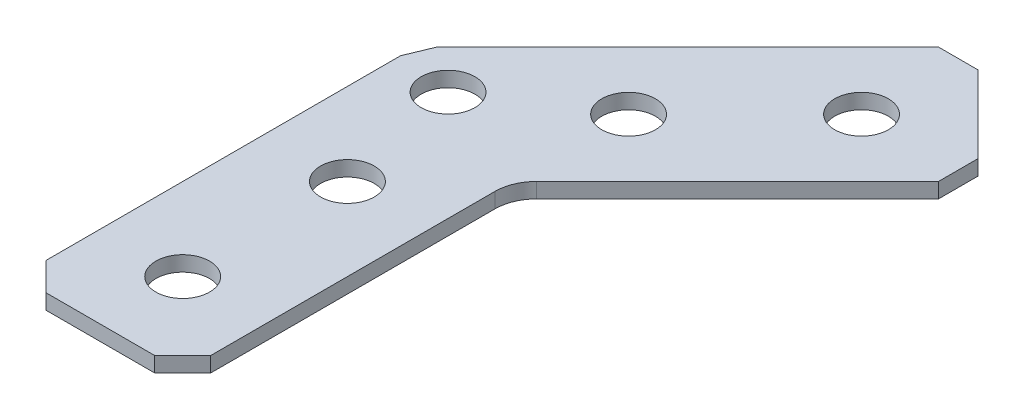
ISO-10303-21;
HEADER;
FILE_DESCRIPTION(('STEP AP214'),'2;1');
FILE_NAME('part.step','',(''),(''),'','','');
FILE_SCHEMA(('AUTOMOTIVE_DESIGN { 1 0 10303 214 1 1 1 1 }'));
ENDSEC;
DATA;
#1=APPLICATION_CONTEXT('core data for automotive mechanical design processes');
#2=APPLICATION_PROTOCOL_DEFINITION('international standard','automotive_design',2000,#1);
#3=PRODUCT_CONTEXT('',#1,'mechanical');
#4=PRODUCT('Part','Part','',(#3));
#5=PRODUCT_RELATED_PRODUCT_CATEGORY('part','',(#4));
#6=PRODUCT_DEFINITION_FORMATION('','',#4);
#7=PRODUCT_DEFINITION_CONTEXT('part definition',#1,'design');
#8=PRODUCT_DEFINITION('design','',#6,#7);
#9=PRODUCT_DEFINITION_SHAPE('','',#8);
#10=(LENGTH_UNIT() NAMED_UNIT(*) SI_UNIT(.MILLI.,.METRE.));
#11=(NAMED_UNIT(*) PLANE_ANGLE_UNIT() SI_UNIT($,.RADIAN.));
#12=(NAMED_UNIT(*) SI_UNIT($,.STERADIAN.) SOLID_ANGLE_UNIT());
#13=UNCERTAINTY_MEASURE_WITH_UNIT(LENGTH_MEASURE(1.E-05),#10,'distance_accuracy_value','');
#14=(GEOMETRIC_REPRESENTATION_CONTEXT(3) GLOBAL_UNCERTAINTY_ASSIGNED_CONTEXT((#13)) GLOBAL_UNIT_ASSIGNED_CONTEXT((#10,
#11,#12)) REPRESENTATION_CONTEXT('',''));
#15=CARTESIAN_POINT('',(0.,0.,0.));
#16=DIRECTION('',(0.,0.,1.));
#17=DIRECTION('',(1.,0.,0.));
#18=AXIS2_PLACEMENT_3D('',#15,#16,#17);
#19=CARTESIAN_POINT('',(22.7838687015566,0.,-32.18715578272));
#20=DIRECTION('',(0.70710678118655,0.,-0.707106781186545));
#21=DIRECTION('',(-0.707106781186545,0.,-0.70710678118655));
#22=AXIS2_PLACEMENT_3D('',#19,#20,#21);
#23=PLANE('',#22);
#24=DIRECTION('',(-0.707106781186545,0.,-0.70710678118655));
#25=VECTOR('',#24,1.);
#26=CARTESIAN_POINT('',(22.7838687015566,1.1684,-32.18715578272));
#27=LINE('',#26,#25);
#28=CARTESIAN_POINT('',(22.7838687015566,1.1684,-32.18715578272));
#29=VERTEX_POINT('',#28);
#30=CARTESIAN_POINT('',(16.856899661651,1.1684,-38.1141248226257));
#31=VERTEX_POINT('',#30);
#32=EDGE_CURVE('E153',#29,#31,#27,.T.);
#33=ORIENTED_EDGE('',*,*,#32,.F.);
#34=DIRECTION('',(0.,1.,0.));
#35=VECTOR('',#34,1.);
#36=CARTESIAN_POINT('',(22.7838687015566,0.,-32.18715578272));
#37=LINE('',#36,#35);
#38=CARTESIAN_POINT('',(22.7838687015566,0.,-32.18715578272));
#39=VERTEX_POINT('',#38);
#40=EDGE_CURVE('E11',#39,#29,#37,.T.);
#41=ORIENTED_EDGE('',*,*,#40,.F.);
#42=DIRECTION('',(-0.707106781186545,0.,-0.70710678118655));
#43=VECTOR('',#42,1.);
#44=CARTESIAN_POINT('',(22.7838687015566,0.,-32.18715578272));
#45=LINE('',#44,#43);
#46=CARTESIAN_POINT('',(16.856899661651,0.,-38.1141248226257));
#47=VERTEX_POINT('',#46);
#48=EDGE_CURVE('E186',#39,#47,#45,.T.);
#49=ORIENTED_EDGE('',*,*,#48,.T.);
#50=DIRECTION('',(0.,1.,0.));
#51=VECTOR('',#50,1.);
#52=CARTESIAN_POINT('',(16.856899661651,0.,-38.1141248226257));
#53=LINE('',#52,#51);
#54=EDGE_CURVE('E35',#47,#31,#53,.T.);
#55=ORIENTED_EDGE('',*,*,#54,.T.);
#56=EDGE_LOOP('',(#33,#41,#49,#55));
#57=FACE_BOUND('',#56,.T.);
#58=ADVANCED_FACE('F32',(#57),#23,.T.);
#59=CARTESIAN_POINT('',(22.7838687015566,0.,-29.1338687015565));
#60=DIRECTION('',(1.,0.,0.));
#61=DIRECTION('',(0.,0.,-1.));
#62=AXIS2_PLACEMENT_3D('',#59,#60,#61);
#63=PLANE('',#62);
#64=DIRECTION('',(0.,0.,-1.));
#65=VECTOR('',#64,1.);
#66=CARTESIAN_POINT('',(22.7838687015566,1.1684,-29.1338687015565));
#67=LINE('',#66,#65);
#68=CARTESIAN_POINT('',(22.7838687015566,1.1684,-29.1338687015565));
#69=VERTEX_POINT('',#68);
#70=EDGE_CURVE('E184',#69,#29,#67,.T.);
#71=ORIENTED_EDGE('',*,*,#70,.F.);
#72=DIRECTION('',(0.,1.,0.));
#73=VECTOR('',#72,1.);
#74=CARTESIAN_POINT('',(22.7838687015566,0.,-29.1338687015565));
#75=LINE('',#74,#73);
#76=CARTESIAN_POINT('',(22.7838687015566,0.,-29.1338687015565));
#77=VERTEX_POINT('',#76);
#78=EDGE_CURVE('E41',#77,#69,#75,.T.);
#79=ORIENTED_EDGE('',*,*,#78,.F.);
#80=DIRECTION('',(0.,0.,-1.));
#81=VECTOR('',#80,1.);
#82=CARTESIAN_POINT('',(22.7838687015566,0.,-29.1338687015565));
#83=LINE('',#82,#81);
#84=EDGE_CURVE('E143',#77,#39,#83,.T.);
#85=ORIENTED_EDGE('',*,*,#84,.T.);
#86=ORIENTED_EDGE('',*,*,#40,.T.);
#87=EDGE_LOOP('',(#71,#79,#85,#86));
#88=FACE_BOUND('',#87,.T.);
#89=ADVANCED_FACE('F206',(#88),#63,.T.);
#90=CARTESIAN_POINT('',(7.27993596973271,0.,-13.6299359697327));
#91=DIRECTION('',(0.707106781186546,0.,0.707106781186549));
#92=DIRECTION('',(0.707106781186549,0.,-0.707106781186546));
#93=AXIS2_PLACEMENT_3D('',#90,#91,#92);
#94=PLANE('',#93);
#95=DIRECTION('',(0.707106781186549,0.,-0.707106781186546));
#96=VECTOR('',#95,1.);
#97=CARTESIAN_POINT('',(7.27993596973271,1.1684,-13.6299359697327));
#98=LINE('',#97,#96);
#99=CARTESIAN_POINT('',(7.27993596973271,1.1684,-13.6299359697327));
#100=VERTEX_POINT('',#99);
#101=EDGE_CURVE('E130',#100,#69,#98,.T.);
#102=ORIENTED_EDGE('',*,*,#101,.F.);
#103=DIRECTION('',(0.,1.,0.));
#104=VECTOR('',#103,1.);
#105=CARTESIAN_POINT('',(7.27993596973271,0.,-13.6299359697327));
#106=LINE('',#105,#104);
#107=CARTESIAN_POINT('',(7.27993596973271,0.,-13.6299359697327));
#108=VERTEX_POINT('',#107);
#109=EDGE_CURVE('E125',#108,#100,#106,.T.);
#110=ORIENTED_EDGE('',*,*,#109,.F.);
#111=DIRECTION('',(0.707106781186549,0.,-0.707106781186546));
#112=VECTOR('',#111,1.);
#113=CARTESIAN_POINT('',(7.27993596973271,0.,-13.6299359697327));
#114=LINE('',#113,#112);
#115=EDGE_CURVE('E128',#108,#77,#114,.T.);
#116=ORIENTED_EDGE('',*,*,#115,.T.);
#117=ORIENTED_EDGE('',*,*,#78,.T.);
#118=EDGE_LOOP('',(#102,#110,#116,#117));
#119=FACE_BOUND('',#118,.T.);
#120=ADVANCED_FACE('F127',(#119),#94,.T.);
#121=CARTESIAN_POINT('',(9.525,0.,-11.3848719394654));
#122=DIRECTION('',(0.,1.,0.));
#123=DIRECTION('',(0.,0.,1.));
#124=AXIS2_PLACEMENT_3D('',#121,#122,#123);
#125=CYLINDRICAL_SURFACE('',#124,3.175);
#126=CARTESIAN_POINT('',(9.525,1.1684,-11.3848719394654));
#127=DIRECTION('',(0.,-1.,0.));
#128=DIRECTION('',(0.,0.,-1.));
#129=AXIS2_PLACEMENT_3D('',#126,#127,#128);
#130=CIRCLE('',#129,3.175);
#131=CARTESIAN_POINT('',(6.35,1.1684,-11.3848719394654));
#132=VERTEX_POINT('',#131);
#133=EDGE_CURVE('E181',#132,#100,#130,.T.);
#134=ORIENTED_EDGE('',*,*,#133,.F.);
#135=DIRECTION('',(0.,1.,0.));
#136=VECTOR('',#135,1.);
#137=CARTESIAN_POINT('',(6.35,0.,-11.3848719394654));
#138=LINE('',#137,#136);
#139=CARTESIAN_POINT('',(6.35,0.,-11.3848719394654));
#140=VERTEX_POINT('',#139);
#141=EDGE_CURVE('E135',#140,#132,#138,.T.);
#142=ORIENTED_EDGE('',*,*,#141,.F.);
#143=CARTESIAN_POINT('',(9.525,0.,-11.3848719394654));
#144=DIRECTION('',(0.,-1.,0.));
#145=DIRECTION('',(0.,0.,-1.));
#146=AXIS2_PLACEMENT_3D('',#143,#144,#145);
#147=CIRCLE('',#146,3.175);
#148=EDGE_CURVE('E141',#140,#108,#147,.T.);
#149=ORIENTED_EDGE('',*,*,#148,.T.);
#150=ORIENTED_EDGE('',*,*,#109,.T.);
#151=EDGE_LOOP('',(#134,#142,#149,#150));
#152=FACE_BOUND('',#151,.T.);
#153=ADVANCED_FACE('F145',(#152),#125,.F.);
#154=CARTESIAN_POINT('',(6.35,0.,10.541));
#155=DIRECTION('',(1.,0.,0.));
#156=DIRECTION('',(0.,0.,-1.));
#157=AXIS2_PLACEMENT_3D('',#154,#155,#156);
#158=PLANE('',#157);
#159=DIRECTION('',(0.,0.,-1.));
#160=VECTOR('',#159,1.);
#161=CARTESIAN_POINT('',(6.35,1.1684,10.541));
#162=LINE('',#161,#160);
#163=CARTESIAN_POINT('',(6.35,1.1684,10.541));
#164=VERTEX_POINT('',#163);
#165=EDGE_CURVE('E178',#164,#132,#162,.T.);
#166=ORIENTED_EDGE('',*,*,#165,.F.);
#167=DIRECTION('',(0.,1.,0.));
#168=VECTOR('',#167,1.);
#169=CARTESIAN_POINT('',(6.35,0.,10.541));
#170=LINE('',#169,#168);
#171=CARTESIAN_POINT('',(6.35,0.,10.541));
#172=VERTEX_POINT('',#171);
#173=EDGE_CURVE('E190',#172,#164,#170,.T.);
#174=ORIENTED_EDGE('',*,*,#173,.F.);
#175=DIRECTION('',(0.,0.,-1.));
#176=VECTOR('',#175,1.);
#177=CARTESIAN_POINT('',(6.35,0.,10.541));
#178=LINE('',#177,#176);
#179=EDGE_CURVE('E146',#172,#140,#178,.T.);
#180=ORIENTED_EDGE('',*,*,#179,.T.);
#181=ORIENTED_EDGE('',*,*,#141,.T.);
#182=EDGE_LOOP('',(#166,#174,#180,#181));
#183=FACE_BOUND('',#182,.T.);
#184=ADVANCED_FACE('F219',(#183),#158,.T.);
#185=CARTESIAN_POINT('',(4.19099999999999,0.,12.7));
#186=DIRECTION('',(0.707106781186546,0.,0.707106781186549));
#187=DIRECTION('',(0.707106781186549,0.,-0.707106781186546));
#188=AXIS2_PLACEMENT_3D('',#185,#186,#187);
#189=PLANE('',#188);
#190=DIRECTION('',(0.707106781186549,0.,-0.707106781186546));
#191=VECTOR('',#190,1.);
#192=CARTESIAN_POINT('',(4.19099999999999,1.1684,12.7));
#193=LINE('',#192,#191);
#194=CARTESIAN_POINT('',(4.19099999999999,1.1684,12.7));
#195=VERTEX_POINT('',#194);
#196=EDGE_CURVE('E175',#195,#164,#193,.T.);
#197=ORIENTED_EDGE('',*,*,#196,.F.);
#198=DIRECTION('',(0.,1.,0.));
#199=VECTOR('',#198,1.);
#200=CARTESIAN_POINT('',(4.19099999999999,0.,12.7));
#201=LINE('',#200,#199);
#202=CARTESIAN_POINT('',(4.19099999999999,0.,12.7));
#203=VERTEX_POINT('',#202);
#204=EDGE_CURVE('E192',#203,#195,#201,.T.);
#205=ORIENTED_EDGE('',*,*,#204,.F.);
#206=DIRECTION('',(0.707106781186549,0.,-0.707106781186546));
#207=VECTOR('',#206,1.);
#208=CARTESIAN_POINT('',(4.19099999999999,0.,12.7));
#209=LINE('',#208,#207);
#210=EDGE_CURVE('E148',#203,#172,#209,.T.);
#211=ORIENTED_EDGE('',*,*,#210,.T.);
#212=ORIENTED_EDGE('',*,*,#173,.T.);
#213=EDGE_LOOP('',(#197,#205,#211,#212));
#214=FACE_BOUND('',#213,.T.);
#215=ADVANCED_FACE('F222',(#214),#189,.T.);
#216=CARTESIAN_POINT('',(-4.191,0.,12.7));
#217=DIRECTION('',(0.,0.,1.));
#218=DIRECTION('',(1.,0.,0.));
#219=AXIS2_PLACEMENT_3D('',#216,#217,#218);
#220=PLANE('',#219);
#221=DIRECTION('',(1.,0.,0.));
#222=VECTOR('',#221,1.);
#223=CARTESIAN_POINT('',(-4.191,1.1684,12.7));
#224=LINE('',#223,#222);
#225=CARTESIAN_POINT('',(-4.191,1.1684,12.7));
#226=VERTEX_POINT('',#225);
#227=EDGE_CURVE('E172',#226,#195,#224,.T.);
#228=ORIENTED_EDGE('',*,*,#227,.F.);
#229=DIRECTION('',(0.,1.,0.));
#230=VECTOR('',#229,1.);
#231=CARTESIAN_POINT('',(-4.191,0.,12.7));
#232=LINE('',#231,#230);
#233=CARTESIAN_POINT('',(-4.191,0.,12.7));
#234=VERTEX_POINT('',#233);
#235=EDGE_CURVE('E194',#234,#226,#232,.T.);
#236=ORIENTED_EDGE('',*,*,#235,.F.);
#237=DIRECTION('',(1.,0.,0.));
#238=VECTOR('',#237,1.);
#239=CARTESIAN_POINT('',(-4.191,0.,12.7));
#240=LINE('',#239,#238);
#241=EDGE_CURVE('E326',#234,#203,#240,.T.);
#242=ORIENTED_EDGE('',*,*,#241,.T.);
#243=ORIENTED_EDGE('',*,*,#204,.T.);
#244=EDGE_LOOP('',(#228,#236,#242,#243));
#245=FACE_BOUND('',#244,.T.);
#246=ADVANCED_FACE('F226',(#245),#220,.T.);
#247=CARTESIAN_POINT('',(-6.34999999999998,0.,10.541));
#248=DIRECTION('',(-0.707106781186547,0.,0.707106781186547));
#249=DIRECTION('',(0.707106781186548,0.,0.707106781186548));
#250=AXIS2_PLACEMENT_3D('',#247,#248,#249);
#251=PLANE('',#250);
#252=DIRECTION('',(0.707106781186548,0.,0.707106781186548));
#253=VECTOR('',#252,1.);
#254=CARTESIAN_POINT('',(-6.34999999999998,1.1684,10.541));
#255=LINE('',#254,#253);
#256=CARTESIAN_POINT('',(-6.34999999999998,1.1684,10.541));
#257=VERTEX_POINT('',#256);
#258=EDGE_CURVE('E169',#257,#226,#255,.T.);
#259=ORIENTED_EDGE('',*,*,#258,.F.);
#260=DIRECTION('',(0.,1.,0.));
#261=VECTOR('',#260,1.);
#262=CARTESIAN_POINT('',(-6.34999999999998,0.,10.541));
#263=LINE('',#262,#261);
#264=CARTESIAN_POINT('',(-6.34999999999998,0.,10.541));
#265=VERTEX_POINT('',#264);
#266=EDGE_CURVE('E196',#265,#257,#263,.T.);
#267=ORIENTED_EDGE('',*,*,#266,.F.);
#268=DIRECTION('',(0.707106781186548,0.,0.707106781186548));
#269=VECTOR('',#268,1.);
#270=CARTESIAN_POINT('',(-6.34999999999998,0.,10.541));
#271=LINE('',#270,#269);
#272=EDGE_CURVE('E323',#265,#234,#271,.T.);
#273=ORIENTED_EDGE('',*,*,#272,.T.);
#274=ORIENTED_EDGE('',*,*,#235,.T.);
#275=EDGE_LOOP('',(#259,#267,#273,#274));
#276=FACE_BOUND('',#275,.T.);
#277=ADVANCED_FACE('F230',(#276),#251,.T.);
#278=CARTESIAN_POINT('',(-6.34999999999999,0.,-16.7920698619227));
#279=DIRECTION('',(-1.,0.,0.));
#280=DIRECTION('',(0.,0.,1.));
#281=AXIS2_PLACEMENT_3D('',#278,#279,#280);
#282=PLANE('',#281);
#283=DIRECTION('',(0.,0.,1.));
#284=VECTOR('',#283,1.);
#285=CARTESIAN_POINT('',(-6.34999999999999,1.1684,-16.7920698619227));
#286=LINE('',#285,#284);
#287=CARTESIAN_POINT('',(-6.34999999999999,1.1684,-16.7920698619227));
#288=VERTEX_POINT('',#287);
#289=EDGE_CURVE('E166',#288,#257,#286,.T.);
#290=ORIENTED_EDGE('',*,*,#289,.F.);
#291=DIRECTION('',(0.,1.,0.));
#292=VECTOR('',#291,1.);
#293=CARTESIAN_POINT('',(-6.34999999999999,0.,-16.7920698619227));
#294=LINE('',#293,#292);
#295=CARTESIAN_POINT('',(-6.34999999999999,0.,-16.7920698619227));
#296=VERTEX_POINT('',#295);
#297=EDGE_CURVE('E198',#296,#288,#294,.T.);
#298=ORIENTED_EDGE('',*,*,#297,.F.);
#299=DIRECTION('',(0.,0.,1.));
#300=VECTOR('',#299,1.);
#301=CARTESIAN_POINT('',(-6.34999999999999,0.,-16.7920698619227));
#302=LINE('',#301,#300);
#303=EDGE_CURVE('E320',#296,#265,#302,.T.);
#304=ORIENTED_EDGE('',*,*,#303,.T.);
#305=ORIENTED_EDGE('',*,*,#266,.T.);
#306=EDGE_LOOP('',(#290,#298,#304,#305));
#307=FACE_BOUND('',#306,.T.);
#308=ADVANCED_FACE('F234',(#307),#282,.T.);
#309=CARTESIAN_POINT('',(-5.52378646952377,0.,-18.7867257726145));
#310=DIRECTION('',(-0.923879532511288,0.,-0.382683432365088));
#311=DIRECTION('',(-0.382683432365088,0.,0.923879532511288));
#312=AXIS2_PLACEMENT_3D('',#309,#310,#311);
#313=PLANE('',#312);
#314=DIRECTION('',(-0.382683432365088,0.,0.923879532511288));
#315=VECTOR('',#314,1.);
#316=CARTESIAN_POINT('',(-5.52378646952377,1.1684,-18.7867257726145));
#317=LINE('',#316,#315);
#318=CARTESIAN_POINT('',(-5.52378646952377,1.1684,-18.7867257726145));
#319=VERTEX_POINT('',#318);
#320=EDGE_CURVE('E163',#319,#288,#317,.T.);
#321=ORIENTED_EDGE('',*,*,#320,.F.);
#322=DIRECTION('',(0.,1.,0.));
#323=VECTOR('',#322,1.);
#324=CARTESIAN_POINT('',(-5.52378646952377,0.,-18.7867257726145));
#325=LINE('',#324,#323);
#326=CARTESIAN_POINT('',(-5.52378646952377,0.,-18.7867257726145));
#327=VERTEX_POINT('',#326);
#328=EDGE_CURVE('E200',#327,#319,#325,.T.);
#329=ORIENTED_EDGE('',*,*,#328,.F.);
#330=DIRECTION('',(-0.382683432365088,0.,0.923879532511288));
#331=VECTOR('',#330,1.);
#332=CARTESIAN_POINT('',(-5.52378646952377,0.,-18.7867257726145));
#333=LINE('',#332,#331);
#334=EDGE_CURVE('E317',#327,#296,#333,.T.);
#335=ORIENTED_EDGE('',*,*,#334,.T.);
#336=ORIENTED_EDGE('',*,*,#297,.T.);
#337=EDGE_LOOP('',(#321,#329,#335,#336));
#338=FACE_BOUND('',#337,.T.);
#339=ADVANCED_FACE('F238',(#338),#313,.T.);
#340=CARTESIAN_POINT('',(13.8036125804875,0.,-38.1141248226257));
#341=DIRECTION('',(-0.707106781186546,0.,-0.707106781186549));
#342=DIRECTION('',(-0.707106781186549,0.,0.707106781186546));
#343=AXIS2_PLACEMENT_3D('',#340,#341,#342);
#344=PLANE('',#343);
#345=DIRECTION('',(-0.707106781186549,0.,0.707106781186546));
#346=VECTOR('',#345,1.);
#347=CARTESIAN_POINT('',(13.8036125804875,1.1684,-38.1141248226257));
#348=LINE('',#347,#346);
#349=CARTESIAN_POINT('',(13.8036125804875,1.1684,-38.1141248226257));
#350=VERTEX_POINT('',#349);
#351=EDGE_CURVE('E160',#350,#319,#348,.T.);
#352=ORIENTED_EDGE('',*,*,#351,.F.);
#353=DIRECTION('',(0.,1.,0.));
#354=VECTOR('',#353,1.);
#355=CARTESIAN_POINT('',(13.8036125804875,0.,-38.1141248226257));
#356=LINE('',#355,#354);
#357=CARTESIAN_POINT('',(13.8036125804875,0.,-38.1141248226257));
#358=VERTEX_POINT('',#357);
#359=EDGE_CURVE('E201',#358,#350,#356,.T.);
#360=ORIENTED_EDGE('',*,*,#359,.F.);
#361=DIRECTION('',(-0.707106781186549,0.,0.707106781186546));
#362=VECTOR('',#361,1.);
#363=CARTESIAN_POINT('',(13.8036125804875,0.,-38.1141248226257));
#364=LINE('',#363,#362);
#365=EDGE_CURVE('E314',#358,#327,#364,.T.);
#366=ORIENTED_EDGE('',*,*,#365,.T.);
#367=ORIENTED_EDGE('',*,*,#328,.T.);
#368=EDGE_LOOP('',(#352,#360,#366,#367));
#369=FACE_BOUND('',#368,.T.);
#370=ADVANCED_FACE('F242',(#369),#344,.T.);
#371=CARTESIAN_POINT('',(16.856899661651,0.,-38.1141248226257));
#372=DIRECTION('',(0.,0.,-1.));
#373=DIRECTION('',(-1.,0.,0.));
#374=AXIS2_PLACEMENT_3D('',#371,#372,#373);
#375=PLANE('',#374);
#376=DIRECTION('',(-1.,0.,0.));
#377=VECTOR('',#376,1.);
#378=CARTESIAN_POINT('',(16.856899661651,1.1684,-38.1141248226257));
#379=LINE('',#378,#377);
#380=EDGE_CURVE('E156',#31,#350,#379,.T.);
#381=ORIENTED_EDGE('',*,*,#380,.F.);
#382=ORIENTED_EDGE('',*,*,#54,.F.);
#383=DIRECTION('',(-1.,0.,0.));
#384=VECTOR('',#383,1.);
#385=CARTESIAN_POINT('',(16.856899661651,0.,-38.1141248226257));
#386=LINE('',#385,#384);
#387=EDGE_CURVE('E312',#47,#358,#386,.T.);
#388=ORIENTED_EDGE('',*,*,#387,.T.);
#389=ORIENTED_EDGE('',*,*,#359,.T.);
#390=EDGE_LOOP('',(#381,#382,#388,#389));
#391=FACE_BOUND('',#390,.T.);
#392=ADVANCED_FACE('F203',(#391),#375,.T.);
#393=CARTESIAN_POINT('',(9.525,0.,-11.3848719394654));
#394=DIRECTION('',(0.,-1.,0.));
#395=DIRECTION('',(0.,0.,-1.));
#396=AXIS2_PLACEMENT_3D('',#393,#394,#395);
#397=PLANE('',#396);
#398=CARTESIAN_POINT('',(6.34999999999998,0.,-21.6802561210692));
#399=DIRECTION('',(0.,1.,0.));
#400=DIRECTION('',(0.,0.,-1.));
#401=AXIS2_PLACEMENT_3D('',#398,#399,#400);
#402=CIRCLE('',#401,2.0701);
#403=CARTESIAN_POINT('',(6.34999999999998,0.,-23.7503561210692));
#404=VERTEX_POINT('',#403);
#405=EDGE_CURVE('E281',#404,#404,#402,.T.);
#406=ORIENTED_EDGE('',*,*,#405,.T.);
#407=EDGE_LOOP('',(#406));
#408=FACE_BOUND('',#407,.T.);
#409=CARTESIAN_POINT('',(0.,0.,6.35));
#410=DIRECTION('',(0.,1.,0.));
#411=DIRECTION('',(0.,0.,-1.));
#412=AXIS2_PLACEMENT_3D('',#409,#410,#411);
#413=CIRCLE('',#412,2.0701);
#414=CARTESIAN_POINT('',(0.,0.,4.2799));
#415=VERTEX_POINT('',#414);
#416=EDGE_CURVE('E289',#415,#415,#413,.T.);
#417=ORIENTED_EDGE('',*,*,#416,.T.);
#418=EDGE_LOOP('',(#417));
#419=FACE_BOUND('',#418,.T.);
#420=CARTESIAN_POINT('',(-2.08546691384424,0.,-16.1940848006638));
#421=DIRECTION('',(0.,1.,0.));
#422=DIRECTION('',(0.,0.,-1.));
#423=AXIS2_PLACEMENT_3D('',#420,#421,#422);
#424=CIRCLE('',#423,2.0701);
#425=CARTESIAN_POINT('',(-2.08546691384424,0.,-18.2641848006638));
#426=VERTEX_POINT('',#425);
#427=EDGE_CURVE('E295',#426,#426,#424,.T.);
#428=ORIENTED_EDGE('',*,*,#427,.T.);
#429=EDGE_LOOP('',(#428));
#430=FACE_BOUND('',#429,.T.);
#431=CARTESIAN_POINT('',(0.,0.,-6.35000000000009));
#432=DIRECTION('',(0.,1.,0.));
#433=DIRECTION('',(0.,0.,-1.));
#434=AXIS2_PLACEMENT_3D('',#431,#432,#433);
#435=CIRCLE('',#434,2.07009999999998);
#436=CARTESIAN_POINT('',(0.,0.,-8.42010000000007));
#437=VERTEX_POINT('',#436);
#438=EDGE_CURVE('E301',#437,#437,#435,.T.);
#439=ORIENTED_EDGE('',*,*,#438,.T.);
#440=EDGE_LOOP('',(#439));
#441=FACE_BOUND('',#440,.T.);
#442=CARTESIAN_POINT('',(15.3302561210692,0.,-30.6605122421383));
#443=DIRECTION('',(0.,1.,0.));
#444=DIRECTION('',(0.,0.,-1.));
#445=AXIS2_PLACEMENT_3D('',#442,#443,#444);
#446=CIRCLE('',#445,2.0701);
#447=CARTESIAN_POINT('',(15.3302561210692,0.,-32.7306122421383));
#448=VERTEX_POINT('',#447);
#449=EDGE_CURVE('E157',#448,#448,#446,.T.);
#450=ORIENTED_EDGE('',*,*,#449,.T.);
#451=EDGE_LOOP('',(#450));
#452=FACE_BOUND('',#451,.T.);
#453=ORIENTED_EDGE('',*,*,#48,.F.);
#454=ORIENTED_EDGE('',*,*,#84,.F.);
#455=ORIENTED_EDGE('',*,*,#115,.F.);
#456=ORIENTED_EDGE('',*,*,#148,.F.);
#457=ORIENTED_EDGE('',*,*,#179,.F.);
#458=ORIENTED_EDGE('',*,*,#210,.F.);
#459=ORIENTED_EDGE('',*,*,#241,.F.);
#460=ORIENTED_EDGE('',*,*,#272,.F.);
#461=ORIENTED_EDGE('',*,*,#303,.F.);
#462=ORIENTED_EDGE('',*,*,#334,.F.);
#463=ORIENTED_EDGE('',*,*,#365,.F.);
#464=ORIENTED_EDGE('',*,*,#387,.F.);
#465=EDGE_LOOP('',(#453,#454,#455,#456,#457,#458,#459,#460,#461,#462,#463,#464));
#466=FACE_BOUND('',#465,.T.);
#467=ADVANCED_FACE('F139',(#408,#419,#430,#441,#452,#466),#397,.T.);
#468=CARTESIAN_POINT('',(9.525,1.1684,-11.3848719394654));
#469=DIRECTION('',(0.,-1.,0.));
#470=DIRECTION('',(0.,0.,-1.));
#471=AXIS2_PLACEMENT_3D('',#468,#469,#470);
#472=PLANE('',#471);
#473=CARTESIAN_POINT('',(6.34999999999998,1.1684,-21.6802561210692));
#474=DIRECTION('',(0.,1.,0.));
#475=DIRECTION('',(0.,0.,-1.));
#476=AXIS2_PLACEMENT_3D('',#473,#474,#475);
#477=CIRCLE('',#476,2.0701);
#478=CARTESIAN_POINT('',(6.34999999999998,1.1684,-23.7503561210692));
#479=VERTEX_POINT('',#478);
#480=EDGE_CURVE('E284',#479,#479,#477,.T.);
#481=ORIENTED_EDGE('',*,*,#480,.F.);
#482=EDGE_LOOP('',(#481));
#483=FACE_BOUND('',#482,.T.);
#484=CARTESIAN_POINT('',(0.,1.1684,6.35));
#485=DIRECTION('',(0.,1.,0.));
#486=DIRECTION('',(0.,0.,-1.));
#487=AXIS2_PLACEMENT_3D('',#484,#485,#486);
#488=CIRCLE('',#487,2.0701);
#489=CARTESIAN_POINT('',(0.,1.1684,4.2799));
#490=VERTEX_POINT('',#489);
#491=EDGE_CURVE('E286',#490,#490,#488,.T.);
#492=ORIENTED_EDGE('',*,*,#491,.F.);
#493=EDGE_LOOP('',(#492));
#494=FACE_BOUND('',#493,.T.);
#495=CARTESIAN_POINT('',(-2.08546691384424,1.1684,-16.1940848006638));
#496=DIRECTION('',(0.,1.,0.));
#497=DIRECTION('',(0.,0.,-1.));
#498=AXIS2_PLACEMENT_3D('',#495,#496,#497);
#499=CIRCLE('',#498,2.0701);
#500=CARTESIAN_POINT('',(-2.08546691384424,1.1684,-18.2641848006638));
#501=VERTEX_POINT('',#500);
#502=EDGE_CURVE('E292',#501,#501,#499,.T.);
#503=ORIENTED_EDGE('',*,*,#502,.F.);
#504=EDGE_LOOP('',(#503));
#505=FACE_BOUND('',#504,.T.);
#506=CARTESIAN_POINT('',(0.,1.1684,-6.35000000000009));
#507=DIRECTION('',(0.,1.,0.));
#508=DIRECTION('',(0.,0.,-1.));
#509=AXIS2_PLACEMENT_3D('',#506,#507,#508);
#510=CIRCLE('',#509,2.07009999999998);
#511=CARTESIAN_POINT('',(0.,1.1684,-8.42010000000007));
#512=VERTEX_POINT('',#511);
#513=EDGE_CURVE('E298',#512,#512,#510,.T.);
#514=ORIENTED_EDGE('',*,*,#513,.F.);
#515=EDGE_LOOP('',(#514));
#516=FACE_BOUND('',#515,.T.);
#517=CARTESIAN_POINT('',(15.3302561210692,1.1684,-30.6605122421383));
#518=DIRECTION('',(0.,1.,0.));
#519=DIRECTION('',(0.,0.,-1.));
#520=AXIS2_PLACEMENT_3D('',#517,#518,#519);
#521=CIRCLE('',#520,2.0701);
#522=CARTESIAN_POINT('',(15.3302561210692,1.1684,-32.7306122421383));
#523=VERTEX_POINT('',#522);
#524=EDGE_CURVE('E304',#523,#523,#521,.T.);
#525=ORIENTED_EDGE('',*,*,#524,.F.);
#526=EDGE_LOOP('',(#525));
#527=FACE_BOUND('',#526,.T.);
#528=ORIENTED_EDGE('',*,*,#32,.T.);
#529=ORIENTED_EDGE('',*,*,#380,.T.);
#530=ORIENTED_EDGE('',*,*,#351,.T.);
#531=ORIENTED_EDGE('',*,*,#320,.T.);
#532=ORIENTED_EDGE('',*,*,#289,.T.);
#533=ORIENTED_EDGE('',*,*,#258,.T.);
#534=ORIENTED_EDGE('',*,*,#227,.T.);
#535=ORIENTED_EDGE('',*,*,#196,.T.);
#536=ORIENTED_EDGE('',*,*,#165,.T.);
#537=ORIENTED_EDGE('',*,*,#133,.T.);
#538=ORIENTED_EDGE('',*,*,#101,.T.);
#539=ORIENTED_EDGE('',*,*,#70,.T.);
#540=EDGE_LOOP('',(#528,#529,#530,#531,#532,#533,#534,#535,#536,#537,#538,#539));
#541=FACE_BOUND('',#540,.T.);
#542=ADVANCED_FACE('F205',(#483,#494,#505,#516,#527,#541),#472,.F.);
#543=CARTESIAN_POINT('',(15.3302561210692,0.,-30.6605122421383));
#544=DIRECTION('',(0.,1.,0.));
#545=DIRECTION('',(0.,0.,1.));
#546=AXIS2_PLACEMENT_3D('',#543,#544,#545);
#547=CYLINDRICAL_SURFACE('',#546,2.0701);
#548=ORIENTED_EDGE('',*,*,#449,.F.);
#549=EDGE_LOOP('',(#548));
#550=FACE_BOUND('',#549,.T.);
#551=ORIENTED_EDGE('',*,*,#524,.T.);
#552=EDGE_LOOP('',(#551));
#553=FACE_BOUND('',#552,.T.);
#554=ADVANCED_FACE('F254',(#550,#553),#547,.F.);
#555=CARTESIAN_POINT('',(0.,0.,-6.35000000000009));
#556=DIRECTION('',(0.,1.,0.));
#557=DIRECTION('',(0.,0.,1.));
#558=AXIS2_PLACEMENT_3D('',#555,#556,#557);
#559=CYLINDRICAL_SURFACE('',#558,2.07009999999998);
#560=ORIENTED_EDGE('',*,*,#438,.F.);
#561=EDGE_LOOP('',(#560));
#562=FACE_BOUND('',#561,.T.);
#563=ORIENTED_EDGE('',*,*,#513,.T.);
#564=EDGE_LOOP('',(#563));
#565=FACE_BOUND('',#564,.T.);
#566=ADVANCED_FACE('F261',(#562,#565),#559,.F.);
#567=CARTESIAN_POINT('',(-2.08546691384424,0.,-16.1940848006638));
#568=DIRECTION('',(0.,1.,0.));
#569=DIRECTION('',(0.,0.,1.));
#570=AXIS2_PLACEMENT_3D('',#567,#568,#569);
#571=CYLINDRICAL_SURFACE('',#570,2.0701);
#572=ORIENTED_EDGE('',*,*,#427,.F.);
#573=EDGE_LOOP('',(#572));
#574=FACE_BOUND('',#573,.T.);
#575=ORIENTED_EDGE('',*,*,#502,.T.);
#576=EDGE_LOOP('',(#575));
#577=FACE_BOUND('',#576,.T.);
#578=ADVANCED_FACE('F265',(#574,#577),#571,.F.);
#579=CARTESIAN_POINT('',(0.,0.,6.35));
#580=DIRECTION('',(0.,1.,0.));
#581=DIRECTION('',(0.,0.,1.));
#582=AXIS2_PLACEMENT_3D('',#579,#580,#581);
#583=CYLINDRICAL_SURFACE('',#582,2.0701);
#584=ORIENTED_EDGE('',*,*,#416,.F.);
#585=EDGE_LOOP('',(#584));
#586=FACE_BOUND('',#585,.T.);
#587=ORIENTED_EDGE('',*,*,#491,.T.);
#588=EDGE_LOOP('',(#587));
#589=FACE_BOUND('',#588,.T.);
#590=ADVANCED_FACE('F269',(#586,#589),#583,.F.);
#591=CARTESIAN_POINT('',(6.34999999999998,0.,-21.6802561210692));
#592=DIRECTION('',(0.,1.,0.));
#593=DIRECTION('',(0.,0.,1.));
#594=AXIS2_PLACEMENT_3D('',#591,#592,#593);
#595=CYLINDRICAL_SURFACE('',#594,2.0701);
#596=ORIENTED_EDGE('',*,*,#405,.F.);
#597=EDGE_LOOP('',(#596));
#598=FACE_BOUND('',#597,.T.);
#599=ORIENTED_EDGE('',*,*,#480,.T.);
#600=EDGE_LOOP('',(#599));
#601=FACE_BOUND('',#600,.T.);
#602=ADVANCED_FACE('F273',(#598,#601),#595,.F.);
#603=CLOSED_SHELL('',(#58,#89,#120,#153,#184,#215,#246,#277,#308,#339,#370,#392,#467,#542,#554,
#566,#578,#590,#602));
#604=MANIFOLD_SOLID_BREP('B2',#603);
#605=ADVANCED_BREP_SHAPE_REPRESENTATION('',(#18,#604),#14);
#606=SHAPE_DEFINITION_REPRESENTATION(#9,#605);
ENDSEC;
END-ISO-10303-21;
